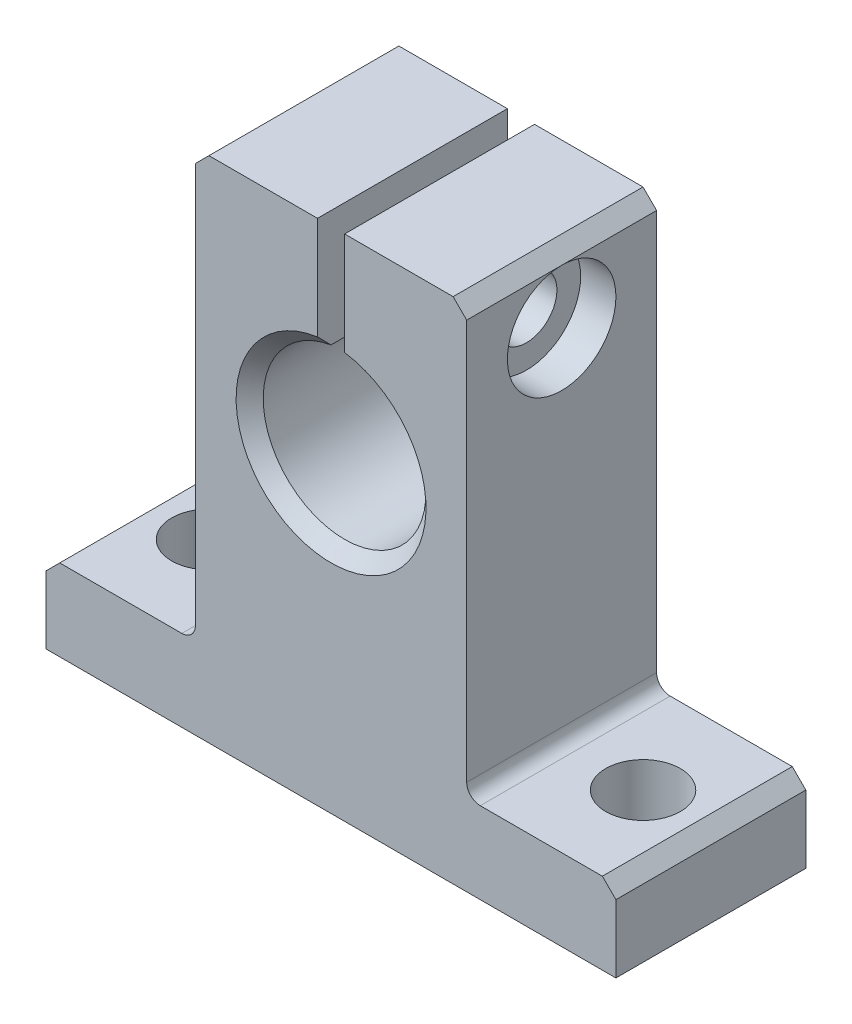
ISO-10303-21;
HEADER;
FILE_DESCRIPTION(('STEP AP214'),'2;1');
FILE_NAME('part.step','',(''),(''),'','','');
FILE_SCHEMA(('AUTOMOTIVE_DESIGN { 1 0 10303 214 1 1 1 1 }'));
ENDSEC;
DATA;
#1=APPLICATION_CONTEXT('core data for automotive mechanical design processes');
#2=APPLICATION_PROTOCOL_DEFINITION('international standard','automotive_design',2000,#1);
#3=PRODUCT_CONTEXT('',#1,'mechanical');
#4=PRODUCT('Part','Part','',(#3));
#5=PRODUCT_RELATED_PRODUCT_CATEGORY('part','',(#4));
#6=PRODUCT_DEFINITION_FORMATION('','',#4);
#7=PRODUCT_DEFINITION_CONTEXT('part definition',#1,'design');
#8=PRODUCT_DEFINITION('design','',#6,#7);
#9=PRODUCT_DEFINITION_SHAPE('','',#8);
#10=(LENGTH_UNIT() NAMED_UNIT(*) SI_UNIT(.MILLI.,.METRE.));
#11=(NAMED_UNIT(*) PLANE_ANGLE_UNIT() SI_UNIT($,.RADIAN.));
#12=(NAMED_UNIT(*) SI_UNIT($,.STERADIAN.) SOLID_ANGLE_UNIT());
#13=UNCERTAINTY_MEASURE_WITH_UNIT(LENGTH_MEASURE(1.E-05),#10,'distance_accuracy_value','');
#14=(GEOMETRIC_REPRESENTATION_CONTEXT(3) GLOBAL_UNCERTAINTY_ASSIGNED_CONTEXT((#13)) GLOBAL_UNIT_ASSIGNED_CONTEXT((#10,
#11,#12)) REPRESENTATION_CONTEXT('',''));
#15=CARTESIAN_POINT('',(0.,0.,0.));
#16=DIRECTION('',(0.,0.,1.));
#17=DIRECTION('',(1.,0.,0.));
#18=AXIS2_PLACEMENT_3D('',#15,#16,#17);
#19=CARTESIAN_POINT('',(0.,23.,14.));
#20=DIRECTION('',(0.,0.,-1.));
#21=DIRECTION('',(-1.,0.,0.));
#22=AXIS2_PLACEMENT_3D('',#19,#20,#21);
#23=CYLINDRICAL_SURFACE('',#22,6.);
#24=DIRECTION('',(0.,0.,-1.));
#25=VECTOR('',#24,1.);
#26=CARTESIAN_POINT('',(0.999999999999999,28.9160797830996,14.));
#27=LINE('',#26,#25);
#28=CARTESIAN_POINT('',(0.999999999999999,28.9160797830996,13.));
#29=VERTEX_POINT('',#28);
#30=CARTESIAN_POINT('',(0.999999999999999,28.9160797830996,1.00000000000002));
#31=VERTEX_POINT('',#30);
#32=EDGE_CURVE('E227',#29,#31,#27,.T.);
#33=ORIENTED_EDGE('',*,*,#32,.T.);
#34=CARTESIAN_POINT('',(0.,23.,1.00000000000002));
#35=DIRECTION('',(0.,0.,1.));
#36=DIRECTION('',(1.,0.,0.));
#37=AXIS2_PLACEMENT_3D('',#34,#35,#36);
#38=CIRCLE('',#37,6.);
#39=CARTESIAN_POINT('',(-0.999999999999999,28.9160797830996,1.00000000000002));
#40=VERTEX_POINT('',#39);
#41=EDGE_CURVE('E314',#31,#40,#38,.F.);
#42=ORIENTED_EDGE('',*,*,#41,.T.);
#43=DIRECTION('',(0.,0.,-1.));
#44=VECTOR('',#43,1.);
#45=CARTESIAN_POINT('',(-0.999999999999999,28.9160797830996,14.));
#46=LINE('',#45,#44);
#47=CARTESIAN_POINT('',(-0.999999999999999,28.9160797830996,13.));
#48=VERTEX_POINT('',#47);
#49=EDGE_CURVE('E198',#48,#40,#46,.T.);
#50=ORIENTED_EDGE('',*,*,#49,.F.);
#51=CARTESIAN_POINT('',(0.,23.,13.));
#52=DIRECTION('',(0.,0.,1.));
#53=DIRECTION('',(1.,0.,0.));
#54=AXIS2_PLACEMENT_3D('',#51,#52,#53);
#55=CIRCLE('',#54,6.);
#56=EDGE_CURVE('E312',#48,#29,#55,.T.);
#57=ORIENTED_EDGE('',*,*,#56,.T.);
#58=EDGE_LOOP('',(#33,#42,#50,#57));
#59=FACE_BOUND('',#58,.T.);
#60=ADVANCED_FACE('F32',(#59),#23,.F.);
#61=CARTESIAN_POINT('',(-0.999999999999999,37.5,14.));
#62=DIRECTION('',(-1.,0.,0.));
#63=DIRECTION('',(0.,0.,1.));
#64=AXIS2_PLACEMENT_3D('',#61,#62,#63);
#65=PLANE('',#64);
#66=CARTESIAN_POINT('',(-1.,32.5,7.));
#67=DIRECTION('',(1.,0.,0.));
#68=DIRECTION('',(0.,0.,-1.));
#69=AXIS2_PLACEMENT_3D('',#66,#67,#68);
#70=CIRCLE('',#69,2.025);
#71=CARTESIAN_POINT('',(-1.,32.5,4.975));
#72=VERTEX_POINT('',#71);
#73=EDGE_CURVE('E706',#72,#72,#70,.T.);
#74=ORIENTED_EDGE('',*,*,#73,.F.);
#75=EDGE_LOOP('',(#74));
#76=FACE_BOUND('',#75,.T.);
#77=ORIENTED_EDGE('',*,*,#49,.T.);
#78=CARTESIAN_POINT('',(-0.999999999999999,28.9160797830996,1.00000000000002));
#79=CARTESIAN_POINT('',(-0.999999999999999,29.0849233868446,0.833491585824262));
#80=CARTESIAN_POINT('',(-0.999999999999999,29.2536888107414,0.666904043991124));
#81=CARTESIAN_POINT('',(-0.999999999999999,29.5910632931281,0.333570710652427));
#82=CARTESIAN_POINT('',(-0.999999999999999,29.7596723516232,0.166824919152224));
#83=CARTESIAN_POINT('',(-0.999999999999999,29.9282032302755,0.));
#84=B_SPLINE_CURVE_WITH_KNOTS('',3,(#78,#79,#80,#81,#82,#83),.UNSPECIFIED.,.F.,.F.,(4,2,4),(0.,
0.711406070099036,1.42281211611413),.UNSPECIFIED.);
#85=CARTESIAN_POINT('',(-0.999999999999999,29.9282032302755,0.));
#86=VERTEX_POINT('',#85);
#87=EDGE_CURVE('E324',#40,#86,#84,.T.);
#88=ORIENTED_EDGE('',*,*,#87,.T.);
#89=DIRECTION('',(0.,1.,0.));
#90=VECTOR('',#89,1.);
#91=CARTESIAN_POINT('',(-0.999999999999999,37.5,0.));
#92=LINE('',#91,#90);
#93=CARTESIAN_POINT('',(-0.999999999999999,37.5,0.));
#94=VERTEX_POINT('',#93);
#95=EDGE_CURVE('E194',#86,#94,#92,.T.);
#96=ORIENTED_EDGE('',*,*,#95,.T.);
#97=DIRECTION('',(0.,0.,-1.));
#98=VECTOR('',#97,1.);
#99=CARTESIAN_POINT('',(-0.999999999999999,37.5,14.));
#100=LINE('',#99,#98);
#101=CARTESIAN_POINT('',(-0.999999999999999,37.5,14.));
#102=VERTEX_POINT('',#101);
#103=EDGE_CURVE('E190',#102,#94,#100,.T.);
#104=ORIENTED_EDGE('',*,*,#103,.F.);
#105=DIRECTION('',(0.,1.,0.));
#106=VECTOR('',#105,1.);
#107=CARTESIAN_POINT('',(-0.999999999999999,37.5,14.));
#108=LINE('',#107,#106);
#109=CARTESIAN_POINT('',(-0.999999999999999,29.9282032302755,14.));
#110=VERTEX_POINT('',#109);
#111=EDGE_CURVE('E176',#110,#102,#108,.T.);
#112=ORIENTED_EDGE('',*,*,#111,.F.);
#113=CARTESIAN_POINT('',(-0.999999999999999,29.9282032302755,14.));
#114=CARTESIAN_POINT('',(-0.999999999999999,29.7596723516232,13.8331750808478));
#115=CARTESIAN_POINT('',(-0.999999999999999,29.5910632931281,13.6664292893476));
#116=CARTESIAN_POINT('',(-0.999999999999999,29.2536888107414,13.3330959560089));
#117=CARTESIAN_POINT('',(-0.999999999999999,29.0849233868446,13.1665084141758));
#118=CARTESIAN_POINT('',(-0.999999999999999,28.9160797830996,13.));
#119=B_SPLINE_CURVE_WITH_KNOTS('',3,(#113,#114,#115,#116,#117,#118),.UNSPECIFIED.,.F.,.F.,(4,2,
4),(0.,0.711406046015081,1.4228121161141),.UNSPECIFIED.);
#120=EDGE_CURVE('E317',#110,#48,#119,.T.);
#121=ORIENTED_EDGE('',*,*,#120,.T.);
#122=EDGE_LOOP('',(#77,#88,#96,#104,#112,#121));
#123=FACE_BOUND('',#122,.T.);
#124=ADVANCED_FACE('F192',(#76,#123),#65,.F.);
#125=CARTESIAN_POINT('',(-10.,37.5,14.));
#126=DIRECTION('',(0.,-1.,0.));
#127=DIRECTION('',(0.,0.,-1.));
#128=AXIS2_PLACEMENT_3D('',#125,#126,#127);
#129=PLANE('',#128);
#130=DIRECTION('',(-1.,0.,0.));
#131=VECTOR('',#130,1.);
#132=CARTESIAN_POINT('',(-10.,37.5,0.));
#133=LINE('',#132,#131);
#134=CARTESIAN_POINT('',(-9.,37.5,0.));
#135=VERTEX_POINT('',#134);
#136=EDGE_CURVE('E229',#94,#135,#133,.T.);
#137=ORIENTED_EDGE('',*,*,#136,.T.);
#138=DIRECTION('',(0.,0.,1.));
#139=VECTOR('',#138,1.);
#140=CARTESIAN_POINT('',(-9.,37.5,14.));
#141=LINE('',#140,#139);
#142=CARTESIAN_POINT('',(-8.99999999999999,37.5,14.));
#143=VERTEX_POINT('',#142);
#144=EDGE_CURVE('E203',#135,#143,#141,.T.);
#145=ORIENTED_EDGE('',*,*,#144,.T.);
#146=DIRECTION('',(-1.,0.,0.));
#147=VECTOR('',#146,1.);
#148=CARTESIAN_POINT('',(-10.,37.5,14.));
#149=LINE('',#148,#147);
#150=EDGE_CURVE('E181',#102,#143,#149,.T.);
#151=ORIENTED_EDGE('',*,*,#150,.F.);
#152=ORIENTED_EDGE('',*,*,#103,.T.);
#153=EDGE_LOOP('',(#137,#145,#151,#152));
#154=FACE_BOUND('',#153,.T.);
#155=ADVANCED_FACE('F201',(#154),#129,.F.);
#156=CARTESIAN_POINT('',(-10.,5.99999999999999,14.));
#157=DIRECTION('',(1.,0.,0.));
#158=DIRECTION('',(0.,0.,-1.));
#159=AXIS2_PLACEMENT_3D('',#156,#157,#158);
#160=PLANE('',#159);
#161=CARTESIAN_POINT('',(-10.,32.5,7.));
#162=DIRECTION('',(1.,0.,0.));
#163=DIRECTION('',(0.,0.,-1.));
#164=AXIS2_PLACEMENT_3D('',#161,#162,#163);
#165=CIRCLE('',#164,1.65);
#166=CARTESIAN_POINT('',(-10.,32.5,5.35));
#167=VERTEX_POINT('',#166);
#168=EDGE_CURVE('E262',#167,#167,#165,.T.);
#169=ORIENTED_EDGE('',*,*,#168,.T.);
#170=EDGE_LOOP('',(#169));
#171=FACE_BOUND('',#170,.T.);
#172=DIRECTION('',(0.,-1.,0.));
#173=VECTOR('',#172,1.);
#174=CARTESIAN_POINT('',(-10.,5.99999999999999,14.));
#175=LINE('',#174,#173);
#176=CARTESIAN_POINT('',(-10.,36.5,14.));
#177=VERTEX_POINT('',#176);
#178=CARTESIAN_POINT('',(-10.,6.99999999999999,14.));
#179=VERTEX_POINT('',#178);
#180=EDGE_CURVE('E204',#177,#179,#175,.T.);
#181=ORIENTED_EDGE('',*,*,#180,.F.);
#182=DIRECTION('',(0.,0.,-1.));
#183=VECTOR('',#182,1.);
#184=CARTESIAN_POINT('',(-10.,36.5,14.));
#185=LINE('',#184,#183);
#186=CARTESIAN_POINT('',(-10.,36.5,0.));
#187=VERTEX_POINT('',#186);
#188=EDGE_CURVE('E366',#177,#187,#185,.T.);
#189=ORIENTED_EDGE('',*,*,#188,.T.);
#190=DIRECTION('',(0.,-1.,0.));
#191=VECTOR('',#190,1.);
#192=CARTESIAN_POINT('',(-10.,5.99999999999999,0.));
#193=LINE('',#192,#191);
#194=CARTESIAN_POINT('',(-10.,6.99999999999999,0.));
#195=VERTEX_POINT('',#194);
#196=EDGE_CURVE('E232',#187,#195,#193,.T.);
#197=ORIENTED_EDGE('',*,*,#196,.T.);
#198=DIRECTION('',(0.,0.,-1.));
#199=VECTOR('',#198,1.);
#200=CARTESIAN_POINT('',(-10.,6.99999999999999,14.));
#201=LINE('',#200,#199);
#202=EDGE_CURVE('E269',#195,#179,#201,.F.);
#203=ORIENTED_EDGE('',*,*,#202,.T.);
#204=EDGE_LOOP('',(#181,#189,#197,#203));
#205=FACE_BOUND('',#204,.T.);
#206=ADVANCED_FACE('F406',(#171,#205),#160,.F.);
#207=CARTESIAN_POINT('',(-21.,5.99999999999999,14.));
#208=DIRECTION('',(0.,-1.,0.));
#209=DIRECTION('',(0.,0.,-1.));
#210=AXIS2_PLACEMENT_3D('',#207,#208,#209);
#211=PLANE('',#210);
#212=CARTESIAN_POINT('',(-16.,5.99999999999999,7.));
#213=DIRECTION('',(0.,1.,0.));
#214=DIRECTION('',(0.,0.,1.));
#215=AXIS2_PLACEMENT_3D('',#212,#213,#214);
#216=CIRCLE('',#215,2.75);
#217=CARTESIAN_POINT('',(-16.,5.99999999999999,9.75));
#218=VERTEX_POINT('',#217);
#219=EDGE_CURVE('E689',#218,#218,#216,.T.);
#220=ORIENTED_EDGE('',*,*,#219,.F.);
#221=EDGE_LOOP('',(#220));
#222=FACE_BOUND('',#221,.T.);
#223=DIRECTION('',(-1.,0.,0.));
#224=VECTOR('',#223,1.);
#225=CARTESIAN_POINT('',(-21.,5.99999999999999,0.));
#226=LINE('',#225,#224);
#227=CARTESIAN_POINT('',(-11.,5.99999999999999,0.));
#228=VERTEX_POINT('',#227);
#229=CARTESIAN_POINT('',(-20.,5.99999999999999,0.));
#230=VERTEX_POINT('',#229);
#231=EDGE_CURVE('E234',#228,#230,#226,.T.);
#232=ORIENTED_EDGE('',*,*,#231,.T.);
#233=DIRECTION('',(0.,0.,1.));
#234=VECTOR('',#233,1.);
#235=CARTESIAN_POINT('',(-20.,5.99999999999999,14.));
#236=LINE('',#235,#234);
#237=CARTESIAN_POINT('',(-20.,5.99999999999999,14.));
#238=VERTEX_POINT('',#237);
#239=EDGE_CURVE('E301',#230,#238,#236,.T.);
#240=ORIENTED_EDGE('',*,*,#239,.T.);
#241=DIRECTION('',(-1.,0.,0.));
#242=VECTOR('',#241,1.);
#243=CARTESIAN_POINT('',(-21.,5.99999999999999,14.));
#244=LINE('',#243,#242);
#245=CARTESIAN_POINT('',(-11.,5.99999999999999,14.));
#246=VERTEX_POINT('',#245);
#247=EDGE_CURVE('E206',#246,#238,#244,.T.);
#248=ORIENTED_EDGE('',*,*,#247,.F.);
#249=DIRECTION('',(0.,0.,-1.));
#250=VECTOR('',#249,1.);
#251=CARTESIAN_POINT('',(-11.,5.99999999999999,0.));
#252=LINE('',#251,#250);
#253=EDGE_CURVE('E261',#246,#228,#252,.T.);
#254=ORIENTED_EDGE('',*,*,#253,.T.);
#255=EDGE_LOOP('',(#232,#240,#248,#254));
#256=FACE_BOUND('',#255,.T.);
#257=ADVANCED_FACE('F403',(#222,#256),#211,.F.);
#258=CARTESIAN_POINT('',(-21.,0.,14.));
#259=DIRECTION('',(1.,0.,0.));
#260=DIRECTION('',(0.,0.,-1.));
#261=AXIS2_PLACEMENT_3D('',#258,#259,#260);
#262=PLANE('',#261);
#263=DIRECTION('',(0.,-1.,0.));
#264=VECTOR('',#263,1.);
#265=CARTESIAN_POINT('',(-21.,0.,14.));
#266=LINE('',#265,#264);
#267=CARTESIAN_POINT('',(-21.,5.,14.));
#268=VERTEX_POINT('',#267);
#269=CARTESIAN_POINT('',(-21.,0.,14.));
#270=VERTEX_POINT('',#269);
#271=EDGE_CURVE('E211',#268,#270,#266,.T.);
#272=ORIENTED_EDGE('',*,*,#271,.F.);
#273=DIRECTION('',(0.,0.,-1.));
#274=VECTOR('',#273,1.);
#275=CARTESIAN_POINT('',(-21.,5.,14.));
#276=LINE('',#275,#274);
#277=CARTESIAN_POINT('',(-21.,5.,0.));
#278=VERTEX_POINT('',#277);
#279=EDGE_CURVE('E288',#268,#278,#276,.T.);
#280=ORIENTED_EDGE('',*,*,#279,.T.);
#281=DIRECTION('',(0.,-1.,0.));
#282=VECTOR('',#281,1.);
#283=CARTESIAN_POINT('',(-21.,0.,0.));
#284=LINE('',#283,#282);
#285=CARTESIAN_POINT('',(-21.,0.,0.));
#286=VERTEX_POINT('',#285);
#287=EDGE_CURVE('E237',#278,#286,#284,.T.);
#288=ORIENTED_EDGE('',*,*,#287,.T.);
#289=DIRECTION('',(0.,0.,-1.));
#290=VECTOR('',#289,1.);
#291=CARTESIAN_POINT('',(-21.,0.,14.));
#292=LINE('',#291,#290);
#293=EDGE_CURVE('E199',#270,#286,#292,.T.);
#294=ORIENTED_EDGE('',*,*,#293,.F.);
#295=EDGE_LOOP('',(#272,#280,#288,#294));
#296=FACE_BOUND('',#295,.T.);
#297=ADVANCED_FACE('F399',(#296),#262,.F.);
#298=CARTESIAN_POINT('',(21.,0.,14.));
#299=DIRECTION('',(0.,1.,0.));
#300=DIRECTION('',(0.,0.,1.));
#301=AXIS2_PLACEMENT_3D('',#298,#299,#300);
#302=PLANE('',#301);
#303=CARTESIAN_POINT('',(-16.,0.,7.));
#304=DIRECTION('',(0.,1.,0.));
#305=DIRECTION('',(0.,0.,1.));
#306=AXIS2_PLACEMENT_3D('',#303,#304,#305);
#307=CIRCLE('',#306,2.75);
#308=CARTESIAN_POINT('',(-16.,0.,9.75));
#309=VERTEX_POINT('',#308);
#310=EDGE_CURVE('E686',#309,#309,#307,.T.);
#311=ORIENTED_EDGE('',*,*,#310,.T.);
#312=EDGE_LOOP('',(#311));
#313=FACE_BOUND('',#312,.T.);
#314=CARTESIAN_POINT('',(16.,0.,7.));
#315=DIRECTION('',(0.,1.,0.));
#316=DIRECTION('',(0.,0.,1.));
#317=AXIS2_PLACEMENT_3D('',#314,#315,#316);
#318=CIRCLE('',#317,2.75);
#319=CARTESIAN_POINT('',(16.,0.,9.75));
#320=VERTEX_POINT('',#319);
#321=EDGE_CURVE('E230',#320,#320,#318,.T.);
#322=ORIENTED_EDGE('',*,*,#321,.T.);
#323=EDGE_LOOP('',(#322));
#324=FACE_BOUND('',#323,.T.);
#325=DIRECTION('',(1.,0.,0.));
#326=VECTOR('',#325,1.);
#327=CARTESIAN_POINT('',(21.,0.,0.));
#328=LINE('',#327,#326);
#329=CARTESIAN_POINT('',(21.,0.,0.));
#330=VERTEX_POINT('',#329);
#331=EDGE_CURVE('E239',#286,#330,#328,.T.);
#332=ORIENTED_EDGE('',*,*,#331,.T.);
#333=DIRECTION('',(0.,0.,-1.));
#334=VECTOR('',#333,1.);
#335=CARTESIAN_POINT('',(21.,0.,14.));
#336=LINE('',#335,#334);
#337=CARTESIAN_POINT('',(21.,0.,14.));
#338=VERTEX_POINT('',#337);
#339=EDGE_CURVE('E255',#338,#330,#336,.T.);
#340=ORIENTED_EDGE('',*,*,#339,.F.);
#341=DIRECTION('',(1.,0.,0.));
#342=VECTOR('',#341,1.);
#343=CARTESIAN_POINT('',(21.,0.,14.));
#344=LINE('',#343,#342);
#345=EDGE_CURVE('E213',#270,#338,#344,.T.);
#346=ORIENTED_EDGE('',*,*,#345,.F.);
#347=ORIENTED_EDGE('',*,*,#293,.T.);
#348=EDGE_LOOP('',(#332,#340,#346,#347));
#349=FACE_BOUND('',#348,.T.);
#350=ADVANCED_FACE('F395',(#313,#324,#349),#302,.F.);
#351=CARTESIAN_POINT('',(21.,0.,14.));
#352=DIRECTION('',(-1.,0.,0.));
#353=DIRECTION('',(0.,0.,1.));
#354=AXIS2_PLACEMENT_3D('',#351,#352,#353);
#355=PLANE('',#354);
#356=DIRECTION('',(0.,1.,0.));
#357=VECTOR('',#356,1.);
#358=CARTESIAN_POINT('',(21.,0.,0.));
#359=LINE('',#358,#357);
#360=CARTESIAN_POINT('',(21.,5.,0.));
#361=VERTEX_POINT('',#360);
#362=EDGE_CURVE('E241',#330,#361,#359,.T.);
#363=ORIENTED_EDGE('',*,*,#362,.T.);
#364=DIRECTION('',(0.,0.,1.));
#365=VECTOR('',#364,1.);
#366=CARTESIAN_POINT('',(21.,5.,14.));
#367=LINE('',#366,#365);
#368=CARTESIAN_POINT('',(21.,5.,14.));
#369=VERTEX_POINT('',#368);
#370=EDGE_CURVE('E11',#361,#369,#367,.T.);
#371=ORIENTED_EDGE('',*,*,#370,.T.);
#372=DIRECTION('',(0.,1.,0.));
#373=VECTOR('',#372,1.);
#374=CARTESIAN_POINT('',(21.,0.,14.));
#375=LINE('',#374,#373);
#376=EDGE_CURVE('E215',#338,#369,#375,.T.);
#377=ORIENTED_EDGE('',*,*,#376,.F.);
#378=ORIENTED_EDGE('',*,*,#339,.T.);
#379=EDGE_LOOP('',(#363,#371,#377,#378));
#380=FACE_BOUND('',#379,.T.);
#381=ADVANCED_FACE('F391',(#380),#355,.F.);
#382=CARTESIAN_POINT('',(21.,5.99999999999999,14.));
#383=DIRECTION('',(0.,-1.,0.));
#384=DIRECTION('',(0.,0.,-1.));
#385=AXIS2_PLACEMENT_3D('',#382,#383,#384);
#386=PLANE('',#385);
#387=CARTESIAN_POINT('',(16.,5.99999999999999,7.));
#388=DIRECTION('',(0.,1.,0.));
#389=DIRECTION('',(0.,0.,1.));
#390=AXIS2_PLACEMENT_3D('',#387,#388,#389);
#391=CIRCLE('',#390,2.75);
#392=CARTESIAN_POINT('',(16.,5.99999999999999,9.75));
#393=VERTEX_POINT('',#392);
#394=EDGE_CURVE('E685',#393,#393,#391,.T.);
#395=ORIENTED_EDGE('',*,*,#394,.F.);
#396=EDGE_LOOP('',(#395));
#397=FACE_BOUND('',#396,.T.);
#398=DIRECTION('',(-1.,0.,0.));
#399=VECTOR('',#398,1.);
#400=CARTESIAN_POINT('',(21.,5.99999999999999,14.));
#401=LINE('',#400,#399);
#402=CARTESIAN_POINT('',(20.,5.99999999999999,14.));
#403=VERTEX_POINT('',#402);
#404=CARTESIAN_POINT('',(11.,5.99999999999999,14.));
#405=VERTEX_POINT('',#404);
#406=EDGE_CURVE('E218',#403,#405,#401,.T.);
#407=ORIENTED_EDGE('',*,*,#406,.F.);
#408=DIRECTION('',(0.,0.,-1.));
#409=VECTOR('',#408,1.);
#410=CARTESIAN_POINT('',(20.,5.99999999999999,14.));
#411=LINE('',#410,#409);
#412=CARTESIAN_POINT('',(20.,5.99999999999999,0.));
#413=VERTEX_POINT('',#412);
#414=EDGE_CURVE('E40',#403,#413,#411,.T.);
#415=ORIENTED_EDGE('',*,*,#414,.T.);
#416=DIRECTION('',(-1.,0.,0.));
#417=VECTOR('',#416,1.);
#418=CARTESIAN_POINT('',(21.,5.99999999999999,0.));
#419=LINE('',#418,#417);
#420=CARTESIAN_POINT('',(11.,5.99999999999999,0.));
#421=VERTEX_POINT('',#420);
#422=EDGE_CURVE('E244',#413,#421,#419,.T.);
#423=ORIENTED_EDGE('',*,*,#422,.T.);
#424=DIRECTION('',(0.,0.,-1.));
#425=VECTOR('',#424,1.);
#426=CARTESIAN_POINT('',(11.,5.99999999999999,14.));
#427=LINE('',#426,#425);
#428=EDGE_CURVE('E275',#421,#405,#427,.F.);
#429=ORIENTED_EDGE('',*,*,#428,.T.);
#430=EDGE_LOOP('',(#407,#415,#423,#429));
#431=FACE_BOUND('',#430,.T.);
#432=ADVANCED_FACE('F388',(#397,#431),#386,.F.);
#433=CARTESIAN_POINT('',(10.,5.99999999999999,14.));
#434=DIRECTION('',(-1.,0.,0.));
#435=DIRECTION('',(0.,0.,1.));
#436=AXIS2_PLACEMENT_3D('',#433,#434,#435);
#437=PLANE('',#436);
#438=DIRECTION('',(0.,1.,0.));
#439=VECTOR('',#438,1.);
#440=CARTESIAN_POINT('',(10.,5.99999999999999,0.));
#441=LINE('',#440,#439);
#442=CARTESIAN_POINT('',(10.,6.99999999999999,0.));
#443=VERTEX_POINT('',#442);
#444=CARTESIAN_POINT('',(10.,36.5,0.));
#445=VERTEX_POINT('',#444);
#446=EDGE_CURVE('E246',#443,#445,#441,.T.);
#447=ORIENTED_EDGE('',*,*,#446,.T.);
#448=DIRECTION('',(0.,0.,1.));
#449=VECTOR('',#448,1.);
#450=CARTESIAN_POINT('',(10.,36.5,14.));
#451=LINE('',#450,#449);
#452=CARTESIAN_POINT('',(10.,36.5,7.));
#453=VERTEX_POINT('',#452);
#454=EDGE_CURVE('E47',#445,#453,#451,.T.);
#455=ORIENTED_EDGE('',*,*,#454,.T.);
#456=CARTESIAN_POINT('',(10.,32.5,7.));
#457=DIRECTION('',(1.,0.,0.));
#458=DIRECTION('',(0.,0.,-1.));
#459=AXIS2_PLACEMENT_3D('',#456,#457,#458);
#460=CIRCLE('',#459,4.);
#461=EDGE_CURVE('E265',#453,#453,#460,.T.);
#462=ORIENTED_EDGE('',*,*,#461,.F.);
#463=DIRECTION('',(0.,0.,1.));
#464=VECTOR('',#463,1.);
#465=CARTESIAN_POINT('',(10.,36.5,14.));
#466=LINE('',#465,#464);
#467=CARTESIAN_POINT('',(10.,36.5,14.));
#468=VERTEX_POINT('',#467);
#469=EDGE_CURVE('E425',#453,#468,#466,.T.);
#470=ORIENTED_EDGE('',*,*,#469,.T.);
#471=DIRECTION('',(0.,1.,0.));
#472=VECTOR('',#471,1.);
#473=CARTESIAN_POINT('',(10.,5.99999999999999,14.));
#474=LINE('',#473,#472);
#475=CARTESIAN_POINT('',(10.,6.99999999999999,14.));
#476=VERTEX_POINT('',#475);
#477=EDGE_CURVE('E220',#476,#468,#474,.T.);
#478=ORIENTED_EDGE('',*,*,#477,.F.);
#479=DIRECTION('',(0.,0.,-1.));
#480=VECTOR('',#479,1.);
#481=CARTESIAN_POINT('',(10.,6.99999999999999,0.));
#482=LINE('',#481,#480);
#483=EDGE_CURVE('E272',#476,#443,#482,.T.);
#484=ORIENTED_EDGE('',*,*,#483,.T.);
#485=EDGE_LOOP('',(#447,#455,#462,#470,#478,#484));
#486=FACE_BOUND('',#485,.T.);
#487=ADVANCED_FACE('F384',(#486),#437,.F.);
#488=CARTESIAN_POINT('',(10.,37.5,14.));
#489=DIRECTION('',(0.,-1.,0.));
#490=DIRECTION('',(0.,0.,-1.));
#491=AXIS2_PLACEMENT_3D('',#488,#489,#490);
#492=PLANE('',#491);
#493=DIRECTION('',(-1.,0.,0.));
#494=VECTOR('',#493,1.);
#495=CARTESIAN_POINT('',(10.,37.5,14.));
#496=LINE('',#495,#494);
#497=CARTESIAN_POINT('',(9.,37.5,14.));
#498=VERTEX_POINT('',#497);
#499=CARTESIAN_POINT('',(0.999999999999999,37.5,14.));
#500=VERTEX_POINT('',#499);
#501=EDGE_CURVE('E223',#498,#500,#496,.T.);
#502=ORIENTED_EDGE('',*,*,#501,.F.);
#503=DIRECTION('',(0.,0.,-1.));
#504=VECTOR('',#503,1.);
#505=CARTESIAN_POINT('',(9.,37.5,14.));
#506=LINE('',#505,#504);
#507=CARTESIAN_POINT('',(9.,37.5,0.));
#508=VERTEX_POINT('',#507);
#509=EDGE_CURVE('E423',#498,#508,#506,.T.);
#510=ORIENTED_EDGE('',*,*,#509,.T.);
#511=DIRECTION('',(-1.,0.,0.));
#512=VECTOR('',#511,1.);
#513=CARTESIAN_POINT('',(10.,37.5,0.));
#514=LINE('',#513,#512);
#515=CARTESIAN_POINT('',(0.999999999999999,37.5,0.));
#516=VERTEX_POINT('',#515);
#517=EDGE_CURVE('E248',#508,#516,#514,.T.);
#518=ORIENTED_EDGE('',*,*,#517,.T.);
#519=DIRECTION('',(0.,0.,-1.));
#520=VECTOR('',#519,1.);
#521=CARTESIAN_POINT('',(0.999999999999999,37.5,14.));
#522=LINE('',#521,#520);
#523=EDGE_CURVE('E252',#500,#516,#522,.T.);
#524=ORIENTED_EDGE('',*,*,#523,.F.);
#525=EDGE_LOOP('',(#502,#510,#518,#524));
#526=FACE_BOUND('',#525,.T.);
#527=ADVANCED_FACE('F377',(#526),#492,.F.);
#528=CARTESIAN_POINT('',(0.999999999999999,37.5,14.));
#529=DIRECTION('',(1.,0.,0.));
#530=DIRECTION('',(0.,0.,-1.));
#531=AXIS2_PLACEMENT_3D('',#528,#529,#530);
#532=PLANE('',#531);
#533=CARTESIAN_POINT('',(0.999999999999999,32.5,7.));
#534=DIRECTION('',(1.,0.,0.));
#535=DIRECTION('',(0.,0.,-1.));
#536=AXIS2_PLACEMENT_3D('',#533,#534,#535);
#537=CIRCLE('',#536,2.25);
#538=CARTESIAN_POINT('',(0.999999999999999,32.5,4.75));
#539=VERTEX_POINT('',#538);
#540=EDGE_CURVE('E694',#539,#539,#537,.T.);
#541=ORIENTED_EDGE('',*,*,#540,.T.);
#542=EDGE_LOOP('',(#541));
#543=FACE_BOUND('',#542,.T.);
#544=DIRECTION('',(0.,-1.,0.));
#545=VECTOR('',#544,1.);
#546=CARTESIAN_POINT('',(0.999999999999999,37.5,0.));
#547=LINE('',#546,#545);
#548=CARTESIAN_POINT('',(0.999999999999999,29.9282032302755,0.));
#549=VERTEX_POINT('',#548);
#550=EDGE_CURVE('E187',#516,#549,#547,.T.);
#551=ORIENTED_EDGE('',*,*,#550,.T.);
#552=CARTESIAN_POINT('',(0.999999999999999,29.9282032302755,0.));
#553=CARTESIAN_POINT('',(0.999999999999999,29.7596723516232,0.166824919152224));
#554=CARTESIAN_POINT('',(0.999999999999999,29.5910632931281,0.333570710652427));
#555=CARTESIAN_POINT('',(0.999999999999999,29.2536888107414,0.666904043991124));
#556=CARTESIAN_POINT('',(0.999999999999999,29.0849233868446,0.833491585824261));
#557=CARTESIAN_POINT('',(0.999999999999999,28.9160797830996,1.00000000000002));
#558=B_SPLINE_CURVE_WITH_KNOTS('',3,(#552,#553,#554,#555,#556,#557),.UNSPECIFIED.,.F.,.F.,(4,2,
4),(0.,0.711406046015096,1.42281211611413),.UNSPECIFIED.);
#559=EDGE_CURVE('E55',#549,#31,#558,.T.);
#560=ORIENTED_EDGE('',*,*,#559,.T.);
#561=ORIENTED_EDGE('',*,*,#32,.F.);
#562=CARTESIAN_POINT('',(0.999999999999999,28.9160797830996,13.));
#563=CARTESIAN_POINT('',(0.999999999999999,29.0849233868446,13.1665084141758));
#564=CARTESIAN_POINT('',(0.999999999999999,29.2536888107414,13.3330959560089));
#565=CARTESIAN_POINT('',(0.999999999999999,29.5910632931281,13.6664292893476));
#566=CARTESIAN_POINT('',(0.999999999999999,29.7596723516232,13.8331750808478));
#567=CARTESIAN_POINT('',(0.999999999999999,29.9282032302755,14.));
#568=B_SPLINE_CURVE_WITH_KNOTS('',3,(#562,#563,#564,#565,#566,#567),.UNSPECIFIED.,.F.,.F.,(4,2,
4),(0.,0.71140607009902,1.4228121161141),.UNSPECIFIED.);
#569=CARTESIAN_POINT('',(0.999999999999999,29.9282032302755,14.));
#570=VERTEX_POINT('',#569);
#571=EDGE_CURVE('E367',#29,#570,#568,.T.);
#572=ORIENTED_EDGE('',*,*,#571,.T.);
#573=DIRECTION('',(0.,-1.,0.));
#574=VECTOR('',#573,1.);
#575=CARTESIAN_POINT('',(0.999999999999999,37.5,14.));
#576=LINE('',#575,#574);
#577=EDGE_CURVE('E225',#500,#570,#576,.T.);
#578=ORIENTED_EDGE('',*,*,#577,.F.);
#579=ORIENTED_EDGE('',*,*,#523,.T.);
#580=EDGE_LOOP('',(#551,#560,#561,#572,#578,#579));
#581=FACE_BOUND('',#580,.T.);
#582=ADVANCED_FACE('F372',(#543,#581),#532,.F.);
#583=CARTESIAN_POINT('',(0.,23.,14.));
#584=DIRECTION('',(0.,0.,1.));
#585=DIRECTION('',(1.,0.,0.));
#586=AXIS2_PLACEMENT_3D('',#583,#584,#585);
#587=PLANE('',#586);
#588=ORIENTED_EDGE('',*,*,#247,.T.);
#589=DIRECTION('',(0.707106781186548,0.707106781186548,0.));
#590=VECTOR('',#589,1.);
#591=CARTESIAN_POINT('',(-1.5,24.5,14.));
#592=LINE('',#591,#590);
#593=EDGE_CURVE('E310',#238,#268,#592,.F.);
#594=ORIENTED_EDGE('',*,*,#593,.T.);
#595=ORIENTED_EDGE('',*,*,#271,.T.);
#596=ORIENTED_EDGE('',*,*,#345,.T.);
#597=ORIENTED_EDGE('',*,*,#376,.T.);
#598=DIRECTION('',(0.707106781186548,-0.707106781186548,0.));
#599=VECTOR('',#598,1.);
#600=CARTESIAN_POINT('',(1.5,24.5,14.));
#601=LINE('',#600,#599);
#602=EDGE_CURVE('E303',#369,#403,#601,.F.);
#603=ORIENTED_EDGE('',*,*,#602,.T.);
#604=ORIENTED_EDGE('',*,*,#406,.T.);
#605=CARTESIAN_POINT('',(11.,6.99999999999999,14.));
#606=DIRECTION('',(0.,0.,1.));
#607=DIRECTION('',(1.,0.,0.));
#608=AXIS2_PLACEMENT_3D('',#605,#606,#607);
#609=CIRCLE('',#608,1.);
#610=EDGE_CURVE('E286',#405,#476,#609,.F.);
#611=ORIENTED_EDGE('',*,*,#610,.T.);
#612=ORIENTED_EDGE('',*,*,#477,.T.);
#613=DIRECTION('',(0.707106781186545,-0.70710678118655,0.));
#614=VECTOR('',#613,1.);
#615=CARTESIAN_POINT('',(11.75,34.75,14.));
#616=LINE('',#615,#614);
#617=EDGE_CURVE('E305',#468,#498,#616,.F.);
#618=ORIENTED_EDGE('',*,*,#617,.T.);
#619=ORIENTED_EDGE('',*,*,#501,.T.);
#620=ORIENTED_EDGE('',*,*,#577,.T.);
#621=CARTESIAN_POINT('',(0.,23.,14.));
#622=DIRECTION('',(0.,0.,1.));
#623=DIRECTION('',(1.,0.,0.));
#624=AXIS2_PLACEMENT_3D('',#621,#622,#623);
#625=CIRCLE('',#624,7.);
#626=EDGE_CURVE('E185',#570,#110,#625,.F.);
#627=ORIENTED_EDGE('',*,*,#626,.T.);
#628=ORIENTED_EDGE('',*,*,#111,.T.);
#629=ORIENTED_EDGE('',*,*,#150,.T.);
#630=DIRECTION('',(0.707106781186552,0.707106781186543,0.));
#631=VECTOR('',#630,1.);
#632=CARTESIAN_POINT('',(-11.7499999999999,34.7500000000001,14.));
#633=LINE('',#632,#631);
#634=EDGE_CURVE('E307',#143,#177,#633,.F.);
#635=ORIENTED_EDGE('',*,*,#634,.T.);
#636=ORIENTED_EDGE('',*,*,#180,.T.);
#637=CARTESIAN_POINT('',(-11.,6.99999999999999,14.));
#638=DIRECTION('',(0.,0.,1.));
#639=DIRECTION('',(1.,0.,0.));
#640=AXIS2_PLACEMENT_3D('',#637,#638,#639);
#641=CIRCLE('',#640,1.);
#642=EDGE_CURVE('E281',#179,#246,#641,.F.);
#643=ORIENTED_EDGE('',*,*,#642,.T.);
#644=EDGE_LOOP('',(#588,#594,#595,#596,#597,#603,#604,#611,#612,#618,#619,#620,#627,#628,#629,
#635,#636,#643));
#645=FACE_BOUND('',#644,.T.);
#646=ADVANCED_FACE('F179',(#645),#587,.T.);
#647=CARTESIAN_POINT('',(0.,23.,0.));
#648=DIRECTION('',(0.,0.,1.));
#649=DIRECTION('',(1.,0.,0.));
#650=AXIS2_PLACEMENT_3D('',#647,#648,#649);
#651=PLANE('',#650);
#652=ORIENTED_EDGE('',*,*,#287,.F.);
#653=DIRECTION('',(-0.707106781186548,-0.707106781186548,0.));
#654=VECTOR('',#653,1.);
#655=CARTESIAN_POINT('',(-21.,5.,0.));
#656=LINE('',#655,#654);
#657=EDGE_CURVE('E299',#278,#230,#656,.F.);
#658=ORIENTED_EDGE('',*,*,#657,.T.);
#659=ORIENTED_EDGE('',*,*,#231,.F.);
#660=CARTESIAN_POINT('',(-11.,6.99999999999999,0.));
#661=DIRECTION('',(0.,0.,1.));
#662=DIRECTION('',(1.,0.,0.));
#663=AXIS2_PLACEMENT_3D('',#660,#661,#662);
#664=CIRCLE('',#663,1.);
#665=EDGE_CURVE('E278',#228,#195,#664,.T.);
#666=ORIENTED_EDGE('',*,*,#665,.T.);
#667=ORIENTED_EDGE('',*,*,#196,.F.);
#668=DIRECTION('',(-0.707106781186552,-0.707106781186543,0.));
#669=VECTOR('',#668,1.);
#670=CARTESIAN_POINT('',(-10.,36.5,0.));
#671=LINE('',#670,#669);
#672=EDGE_CURVE('E295',#187,#135,#671,.F.);
#673=ORIENTED_EDGE('',*,*,#672,.T.);
#674=ORIENTED_EDGE('',*,*,#136,.F.);
#675=ORIENTED_EDGE('',*,*,#95,.F.);
#676=CARTESIAN_POINT('',(0.,23.,0.));
#677=DIRECTION('',(0.,0.,1.));
#678=DIRECTION('',(1.,0.,0.));
#679=AXIS2_PLACEMENT_3D('',#676,#677,#678);
#680=CIRCLE('',#679,7.00000000000003);
#681=EDGE_CURVE('E297',#86,#549,#680,.T.);
#682=ORIENTED_EDGE('',*,*,#681,.T.);
#683=ORIENTED_EDGE('',*,*,#550,.F.);
#684=ORIENTED_EDGE('',*,*,#517,.F.);
#685=DIRECTION('',(-0.707106781186545,0.70710678118655,0.));
#686=VECTOR('',#685,1.);
#687=CARTESIAN_POINT('',(9.,37.5,0.));
#688=LINE('',#687,#686);
#689=EDGE_CURVE('E293',#508,#445,#688,.F.);
#690=ORIENTED_EDGE('',*,*,#689,.T.);
#691=ORIENTED_EDGE('',*,*,#446,.F.);
#692=CARTESIAN_POINT('',(11.,6.99999999999999,0.));
#693=DIRECTION('',(0.,0.,1.));
#694=DIRECTION('',(1.,0.,0.));
#695=AXIS2_PLACEMENT_3D('',#692,#693,#694);
#696=CIRCLE('',#695,1.);
#697=EDGE_CURVE('E283',#443,#421,#696,.T.);
#698=ORIENTED_EDGE('',*,*,#697,.T.);
#699=ORIENTED_EDGE('',*,*,#422,.F.);
#700=DIRECTION('',(-0.707106781186548,0.707106781186548,0.));
#701=VECTOR('',#700,1.);
#702=CARTESIAN_POINT('',(20.,5.99999999999999,0.));
#703=LINE('',#702,#701);
#704=EDGE_CURVE('E291',#413,#361,#703,.F.);
#705=ORIENTED_EDGE('',*,*,#704,.T.);
#706=ORIENTED_EDGE('',*,*,#362,.F.);
#707=ORIENTED_EDGE('',*,*,#331,.F.);
#708=EDGE_LOOP('',(#652,#658,#659,#666,#667,#673,#674,#675,#682,#683,#684,#690,#691,#698,#699,
#705,#706,#707));
#709=FACE_BOUND('',#708,.T.);
#710=ADVANCED_FACE('F379',(#709),#651,.F.);
#711=CARTESIAN_POINT('',(16.,5.99999999999999,7.));
#712=DIRECTION('',(0.,1.,0.));
#713=DIRECTION('',(0.,0.,1.));
#714=AXIS2_PLACEMENT_3D('',#711,#712,#713);
#715=CYLINDRICAL_SURFACE('',#714,2.75);
#716=ORIENTED_EDGE('',*,*,#321,.F.);
#717=EDGE_LOOP('',(#716));
#718=FACE_BOUND('',#717,.T.);
#719=ORIENTED_EDGE('',*,*,#394,.T.);
#720=EDGE_LOOP('',(#719));
#721=FACE_BOUND('',#720,.T.);
#722=ADVANCED_FACE('F551',(#718,#721),#715,.F.);
#723=CARTESIAN_POINT('',(-16.,5.99999999999999,7.));
#724=DIRECTION('',(0.,1.,0.));
#725=DIRECTION('',(0.,0.,1.));
#726=AXIS2_PLACEMENT_3D('',#723,#724,#725);
#727=CYLINDRICAL_SURFACE('',#726,2.75);
#728=ORIENTED_EDGE('',*,*,#310,.F.);
#729=EDGE_LOOP('',(#728));
#730=FACE_BOUND('',#729,.T.);
#731=ORIENTED_EDGE('',*,*,#219,.T.);
#732=EDGE_LOOP('',(#731));
#733=FACE_BOUND('',#732,.T.);
#734=ADVANCED_FACE('F543',(#730,#733),#727,.F.);
#735=CARTESIAN_POINT('',(10.,32.5,7.));
#736=DIRECTION('',(1.,0.,0.));
#737=DIRECTION('',(0.,0.,-1.));
#738=AXIS2_PLACEMENT_3D('',#735,#736,#737);
#739=CYLINDRICAL_SURFACE('',#738,2.25);
#740=ORIENTED_EDGE('',*,*,#540,.F.);
#741=EDGE_LOOP('',(#740));
#742=FACE_BOUND('',#741,.T.);
#743=CARTESIAN_POINT('',(7.4,32.5,7.));
#744=DIRECTION('',(1.,0.,0.));
#745=DIRECTION('',(0.,0.,-1.));
#746=AXIS2_PLACEMENT_3D('',#743,#744,#745);
#747=CIRCLE('',#746,2.25);
#748=CARTESIAN_POINT('',(7.4,32.5,4.75));
#749=VERTEX_POINT('',#748);
#750=EDGE_CURVE('E697',#749,#749,#747,.T.);
#751=ORIENTED_EDGE('',*,*,#750,.T.);
#752=EDGE_LOOP('',(#751));
#753=FACE_BOUND('',#752,.T.);
#754=ADVANCED_FACE('F535',(#742,#753),#739,.F.);
#755=CARTESIAN_POINT('',(7.4,34.75,7.));
#756=DIRECTION('',(-1.,0.,0.));
#757=DIRECTION('',(0.,0.,1.));
#758=AXIS2_PLACEMENT_3D('',#755,#756,#757);
#759=PLANE('',#758);
#760=ORIENTED_EDGE('',*,*,#750,.F.);
#761=EDGE_LOOP('',(#760));
#762=FACE_BOUND('',#761,.T.);
#763=CARTESIAN_POINT('',(7.4,32.5,7.));
#764=DIRECTION('',(1.,0.,0.));
#765=DIRECTION('',(0.,0.,-1.));
#766=AXIS2_PLACEMENT_3D('',#763,#764,#765);
#767=CIRCLE('',#766,4.);
#768=CARTESIAN_POINT('',(7.4,32.5,3.));
#769=VERTEX_POINT('',#768);
#770=EDGE_CURVE('E700',#769,#769,#767,.T.);
#771=ORIENTED_EDGE('',*,*,#770,.T.);
#772=EDGE_LOOP('',(#771));
#773=FACE_BOUND('',#772,.T.);
#774=ADVANCED_FACE('F527',(#762,#773),#759,.F.);
#775=CARTESIAN_POINT('',(10.,32.5,7.));
#776=DIRECTION('',(1.,0.,0.));
#777=DIRECTION('',(0.,0.,-1.));
#778=AXIS2_PLACEMENT_3D('',#775,#776,#777);
#779=CYLINDRICAL_SURFACE('',#778,4.);
#780=ORIENTED_EDGE('',*,*,#770,.F.);
#781=EDGE_LOOP('',(#780));
#782=FACE_BOUND('',#781,.T.);
#783=ORIENTED_EDGE('',*,*,#461,.T.);
#784=EDGE_LOOP('',(#783));
#785=FACE_BOUND('',#784,.T.);
#786=ADVANCED_FACE('F519',(#782,#785),#779,.F.);
#787=CARTESIAN_POINT('',(-1.,32.5,7.));
#788=DIRECTION('',(1.,0.,0.));
#789=DIRECTION('',(0.,0.,-1.));
#790=AXIS2_PLACEMENT_3D('',#787,#788,#789);
#791=CYLINDRICAL_SURFACE('',#790,1.65);
#792=CARTESIAN_POINT('',(-1.21650635094611,32.5,7.));
#793=DIRECTION('',(1.,0.,0.));
#794=DIRECTION('',(0.,0.,-1.));
#795=AXIS2_PLACEMENT_3D('',#792,#793,#794);
#796=CIRCLE('',#795,1.65);
#797=CARTESIAN_POINT('',(-1.21650635094611,32.5,5.35));
#798=VERTEX_POINT('',#797);
#799=EDGE_CURVE('E266',#798,#798,#796,.T.);
#800=ORIENTED_EDGE('',*,*,#799,.T.);
#801=EDGE_LOOP('',(#800));
#802=FACE_BOUND('',#801,.T.);
#803=ORIENTED_EDGE('',*,*,#168,.F.);
#804=EDGE_LOOP('',(#803));
#805=FACE_BOUND('',#804,.T.);
#806=ADVANCED_FACE('F511',(#802,#805),#791,.F.);
#807=CARTESIAN_POINT('',(-1.,32.5,7.));
#808=DIRECTION('',(1.,0.,0.));
#809=DIRECTION('',(0.,0.,-1.));
#810=AXIS2_PLACEMENT_3D('',#807,#808,#809);
#811=CONICAL_SURFACE('',#810,2.025,1.0471975511966);
#812=ORIENTED_EDGE('',*,*,#799,.F.);
#813=EDGE_LOOP('',(#812));
#814=FACE_BOUND('',#813,.T.);
#815=ORIENTED_EDGE('',*,*,#73,.T.);
#816=EDGE_LOOP('',(#815));
#817=FACE_BOUND('',#816,.T.);
#818=ADVANCED_FACE('F347',(#814,#817),#811,.F.);
#819=CARTESIAN_POINT('',(-11.,6.99999999999999,14.));
#820=DIRECTION('',(0.,0.,1.));
#821=DIRECTION('',(1.,0.,0.));
#822=AXIS2_PLACEMENT_3D('',#819,#820,#821);
#823=CYLINDRICAL_SURFACE('',#822,1.);
#824=ORIENTED_EDGE('',*,*,#642,.F.);
#825=ORIENTED_EDGE('',*,*,#202,.F.);
#826=ORIENTED_EDGE('',*,*,#665,.F.);
#827=ORIENTED_EDGE('',*,*,#253,.F.);
#828=EDGE_LOOP('',(#824,#825,#826,#827));
#829=FACE_BOUND('',#828,.T.);
#830=ADVANCED_FACE('F343',(#829),#823,.F.);
#831=CARTESIAN_POINT('',(11.,6.99999999999999,14.));
#832=DIRECTION('',(0.,0.,1.));
#833=DIRECTION('',(1.,0.,0.));
#834=AXIS2_PLACEMENT_3D('',#831,#832,#833);
#835=CYLINDRICAL_SURFACE('',#834,1.);
#836=ORIENTED_EDGE('',*,*,#610,.F.);
#837=ORIENTED_EDGE('',*,*,#428,.F.);
#838=ORIENTED_EDGE('',*,*,#697,.F.);
#839=ORIENTED_EDGE('',*,*,#483,.F.);
#840=EDGE_LOOP('',(#836,#837,#838,#839));
#841=FACE_BOUND('',#840,.T.);
#842=ADVANCED_FACE('F346',(#841),#835,.F.);
#843=CARTESIAN_POINT('',(-21.,5.,14.));
#844=DIRECTION('',(0.707106781186547,-0.707106781186547,0.));
#845=DIRECTION('',(0.,0.,-1.));
#846=AXIS2_PLACEMENT_3D('',#843,#844,#845);
#847=PLANE('',#846);
#848=ORIENTED_EDGE('',*,*,#593,.F.);
#849=ORIENTED_EDGE('',*,*,#239,.F.);
#850=ORIENTED_EDGE('',*,*,#657,.F.);
#851=ORIENTED_EDGE('',*,*,#279,.F.);
#852=EDGE_LOOP('',(#848,#849,#850,#851));
#853=FACE_BOUND('',#852,.T.);
#854=ADVANCED_FACE('F351',(#853),#847,.F.);
#855=CARTESIAN_POINT('',(0.,23.,1.00000000000002));
#856=DIRECTION('',(0.,0.,-1.));
#857=DIRECTION('',(-1.,0.,0.));
#858=AXIS2_PLACEMENT_3D('',#855,#856,#857);
#859=CONICAL_SURFACE('',#858,6.,0.785398163397453);
#860=ORIENTED_EDGE('',*,*,#559,.F.);
#861=ORIENTED_EDGE('',*,*,#681,.F.);
#862=ORIENTED_EDGE('',*,*,#87,.F.);
#863=ORIENTED_EDGE('',*,*,#41,.F.);
#864=EDGE_LOOP('',(#860,#861,#862,#863));
#865=FACE_BOUND('',#864,.T.);
#866=ADVANCED_FACE('F354',(#865),#859,.F.);
#867=CARTESIAN_POINT('',(0.,23.,14.));
#868=DIRECTION('',(0.,0.,1.));
#869=DIRECTION('',(1.,0.,0.));
#870=AXIS2_PLACEMENT_3D('',#867,#868,#869);
#871=CONICAL_SURFACE('',#870,7.,0.785398163397445);
#872=ORIENTED_EDGE('',*,*,#571,.F.);
#873=ORIENTED_EDGE('',*,*,#56,.F.);
#874=ORIENTED_EDGE('',*,*,#120,.F.);
#875=ORIENTED_EDGE('',*,*,#626,.F.);
#876=EDGE_LOOP('',(#872,#873,#874,#875));
#877=FACE_BOUND('',#876,.T.);
#878=ADVANCED_FACE('F330',(#877),#871,.F.);
#879=CARTESIAN_POINT('',(-10.,36.5,14.));
#880=DIRECTION('',(0.707106781186543,-0.707106781186552,0.));
#881=DIRECTION('',(0.,0.,-1.));
#882=AXIS2_PLACEMENT_3D('',#879,#880,#881);
#883=PLANE('',#882);
#884=ORIENTED_EDGE('',*,*,#634,.F.);
#885=ORIENTED_EDGE('',*,*,#144,.F.);
#886=ORIENTED_EDGE('',*,*,#672,.F.);
#887=ORIENTED_EDGE('',*,*,#188,.F.);
#888=EDGE_LOOP('',(#884,#885,#886,#887));
#889=FACE_BOUND('',#888,.T.);
#890=ADVANCED_FACE('F422',(#889),#883,.F.);
#891=CARTESIAN_POINT('',(9.,37.5,14.));
#892=DIRECTION('',(-0.70710678118655,-0.707106781186545,0.));
#893=DIRECTION('',(0.,0.,-1.));
#894=AXIS2_PLACEMENT_3D('',#891,#892,#893);
#895=PLANE('',#894);
#896=ORIENTED_EDGE('',*,*,#469,.F.);
#897=ORIENTED_EDGE('',*,*,#454,.F.);
#898=ORIENTED_EDGE('',*,*,#689,.F.);
#899=ORIENTED_EDGE('',*,*,#509,.F.);
#900=ORIENTED_EDGE('',*,*,#617,.F.);
#901=EDGE_LOOP('',(#896,#897,#898,#899,#900));
#902=FACE_BOUND('',#901,.T.);
#903=ADVANCED_FACE('F447',(#902),#895,.F.);
#904=CARTESIAN_POINT('',(20.,5.99999999999999,14.));
#905=DIRECTION('',(-0.707106781186547,-0.707106781186547,0.));
#906=DIRECTION('',(0.,0.,-1.));
#907=AXIS2_PLACEMENT_3D('',#904,#905,#906);
#908=PLANE('',#907);
#909=ORIENTED_EDGE('',*,*,#602,.F.);
#910=ORIENTED_EDGE('',*,*,#370,.F.);
#911=ORIENTED_EDGE('',*,*,#704,.F.);
#912=ORIENTED_EDGE('',*,*,#414,.F.);
#913=EDGE_LOOP('',(#909,#910,#911,#912));
#914=FACE_BOUND('',#913,.T.);
#915=ADVANCED_FACE('F34',(#914),#908,.F.);
#916=CLOSED_SHELL('',(#60,#124,#155,#206,#257,#297,#350,#381,#432,#487,#527,#582,#646,#710,#722,
#734,#754,#774,#786,#806,#818,#830,#842,#854,#866,#878,#890,#903,#915));
#917=MANIFOLD_SOLID_BREP('B2',#916);
#918=ADVANCED_BREP_SHAPE_REPRESENTATION('',(#18,#917),#14);
#919=SHAPE_DEFINITION_REPRESENTATION(#9,#918);
ENDSEC;
END-ISO-10303-21;
